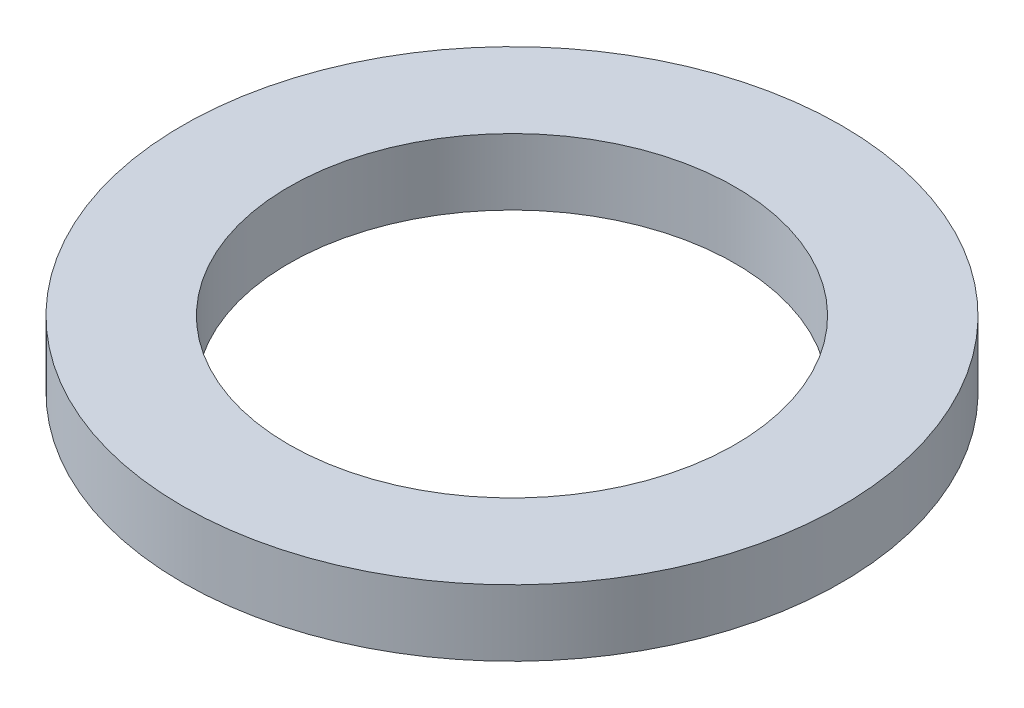
ISO-10303-21;
HEADER;
FILE_DESCRIPTION(('STEP AP214'),'2;1');
FILE_NAME('part.step','',(''),(''),'','','');
FILE_SCHEMA(('AUTOMOTIVE_DESIGN { 1 0 10303 214 1 1 1 1 }'));
ENDSEC;
DATA;
#1=APPLICATION_CONTEXT('core data for automotive mechanical design processes');
#2=APPLICATION_PROTOCOL_DEFINITION('international standard','automotive_design',2000,#1);
#3=PRODUCT_CONTEXT('',#1,'mechanical');
#4=PRODUCT('Part','Part','',(#3));
#5=PRODUCT_RELATED_PRODUCT_CATEGORY('part','',(#4));
#6=PRODUCT_DEFINITION_FORMATION('','',#4);
#7=PRODUCT_DEFINITION_CONTEXT('part definition',#1,'design');
#8=PRODUCT_DEFINITION('design','',#6,#7);
#9=PRODUCT_DEFINITION_SHAPE('','',#8);
#10=(LENGTH_UNIT() NAMED_UNIT(*) SI_UNIT(.MILLI.,.METRE.));
#11=(NAMED_UNIT(*) PLANE_ANGLE_UNIT() SI_UNIT($,.RADIAN.));
#12=(NAMED_UNIT(*) SI_UNIT($,.STERADIAN.) SOLID_ANGLE_UNIT());
#13=UNCERTAINTY_MEASURE_WITH_UNIT(LENGTH_MEASURE(1.E-05),#10,'distance_accuracy_value','');
#14=(GEOMETRIC_REPRESENTATION_CONTEXT(3) GLOBAL_UNCERTAINTY_ASSIGNED_CONTEXT((#13)) GLOBAL_UNIT_ASSIGNED_CONTEXT((#10,
#11,#12)) REPRESENTATION_CONTEXT('',''));
#15=CARTESIAN_POINT('',(0.,0.,0.));
#16=DIRECTION('',(0.,0.,1.));
#17=DIRECTION('',(1.,0.,0.));
#18=AXIS2_PLACEMENT_3D('',#15,#16,#17);
#19=CARTESIAN_POINT('',(0.,8.15,0.));
#20=DIRECTION('',(0.,1.,0.));
#21=DIRECTION('',(0.,0.,1.));
#22=AXIS2_PLACEMENT_3D('',#19,#20,#21);
#23=PLANE('',#22);
#24=CARTESIAN_POINT('',(0.,8.15,0.));
#25=DIRECTION('',(0.,1.,0.));
#26=DIRECTION('',(0.,0.,1.));
#27=AXIS2_PLACEMENT_3D('',#24,#25,#26);
#28=CIRCLE('',#27,40.535);
#29=CARTESIAN_POINT('',(0.,8.15,40.535));
#30=VERTEX_POINT('',#29);
#31=EDGE_CURVE('E10',#30,#30,#28,.T.);
#32=ORIENTED_EDGE('',*,*,#31,.T.);
#33=EDGE_LOOP('',(#32));
#34=FACE_BOUND('',#33,.T.);
#35=CARTESIAN_POINT('',(0.,8.15,0.));
#36=DIRECTION('',(0.,1.,0.));
#37=DIRECTION('',(0.,0.,1.));
#38=AXIS2_PLACEMENT_3D('',#35,#36,#37);
#39=CIRCLE('',#38,27.45);
#40=CARTESIAN_POINT('',(0.,8.15,27.45));
#41=VERTEX_POINT('',#40);
#42=EDGE_CURVE('E44',#41,#41,#39,.T.);
#43=ORIENTED_EDGE('',*,*,#42,.F.);
#44=EDGE_LOOP('',(#43));
#45=FACE_BOUND('',#44,.T.);
#46=ADVANCED_FACE('F33',(#34,#45),#23,.T.);
#47=CARTESIAN_POINT('',(0.,0.,0.));
#48=DIRECTION('',(0.,1.,0.));
#49=DIRECTION('',(0.,0.,1.));
#50=AXIS2_PLACEMENT_3D('',#47,#48,#49);
#51=PLANE('',#50);
#52=CARTESIAN_POINT('',(0.,0.,0.));
#53=DIRECTION('',(0.,1.,0.));
#54=DIRECTION('',(0.,0.,1.));
#55=AXIS2_PLACEMENT_3D('',#52,#53,#54);
#56=CIRCLE('',#55,40.535);
#57=CARTESIAN_POINT('',(0.,0.,40.535));
#58=VERTEX_POINT('',#57);
#59=EDGE_CURVE('E37',#58,#58,#56,.T.);
#60=ORIENTED_EDGE('',*,*,#59,.F.);
#61=EDGE_LOOP('',(#60));
#62=FACE_BOUND('',#61,.T.);
#63=CARTESIAN_POINT('',(0.,0.,0.));
#64=DIRECTION('',(0.,1.,0.));
#65=DIRECTION('',(0.,0.,1.));
#66=AXIS2_PLACEMENT_3D('',#63,#64,#65);
#67=CIRCLE('',#66,27.45);
#68=CARTESIAN_POINT('',(0.,0.,27.45));
#69=VERTEX_POINT('',#68);
#70=EDGE_CURVE('E46',#69,#69,#67,.T.);
#71=ORIENTED_EDGE('',*,*,#70,.T.);
#72=EDGE_LOOP('',(#71));
#73=FACE_BOUND('',#72,.T.);
#74=ADVANCED_FACE('F56',(#62,#73),#51,.F.);
#75=CARTESIAN_POINT('',(0.,8.15,0.));
#76=DIRECTION('',(0.,-1.,0.));
#77=DIRECTION('',(0.,0.,-1.));
#78=AXIS2_PLACEMENT_3D('',#75,#76,#77);
#79=CYLINDRICAL_SURFACE('',#78,40.535);
#80=ORIENTED_EDGE('',*,*,#31,.F.);
#81=EDGE_LOOP('',(#80));
#82=FACE_BOUND('',#81,.T.);
#83=ORIENTED_EDGE('',*,*,#59,.T.);
#84=EDGE_LOOP('',(#83));
#85=FACE_BOUND('',#84,.T.);
#86=ADVANCED_FACE('F35',(#82,#85),#79,.T.);
#87=CARTESIAN_POINT('',(0.,8.15,0.));
#88=DIRECTION('',(0.,-1.,0.));
#89=DIRECTION('',(0.,0.,-1.));
#90=AXIS2_PLACEMENT_3D('',#87,#88,#89);
#91=CYLINDRICAL_SURFACE('',#90,27.45);
#92=ORIENTED_EDGE('',*,*,#42,.T.);
#93=EDGE_LOOP('',(#92));
#94=FACE_BOUND('',#93,.T.);
#95=ORIENTED_EDGE('',*,*,#70,.F.);
#96=EDGE_LOOP('',(#95));
#97=FACE_BOUND('',#96,.T.);
#98=ADVANCED_FACE('F52',(#94,#97),#91,.F.);
#99=CLOSED_SHELL('',(#46,#74,#86,#98));
#100=MANIFOLD_SOLID_BREP('B2',#99);
#101=ADVANCED_BREP_SHAPE_REPRESENTATION('',(#18,#100),#14);
#102=SHAPE_DEFINITION_REPRESENTATION(#9,#101);
ENDSEC;
END-ISO-10303-21;
